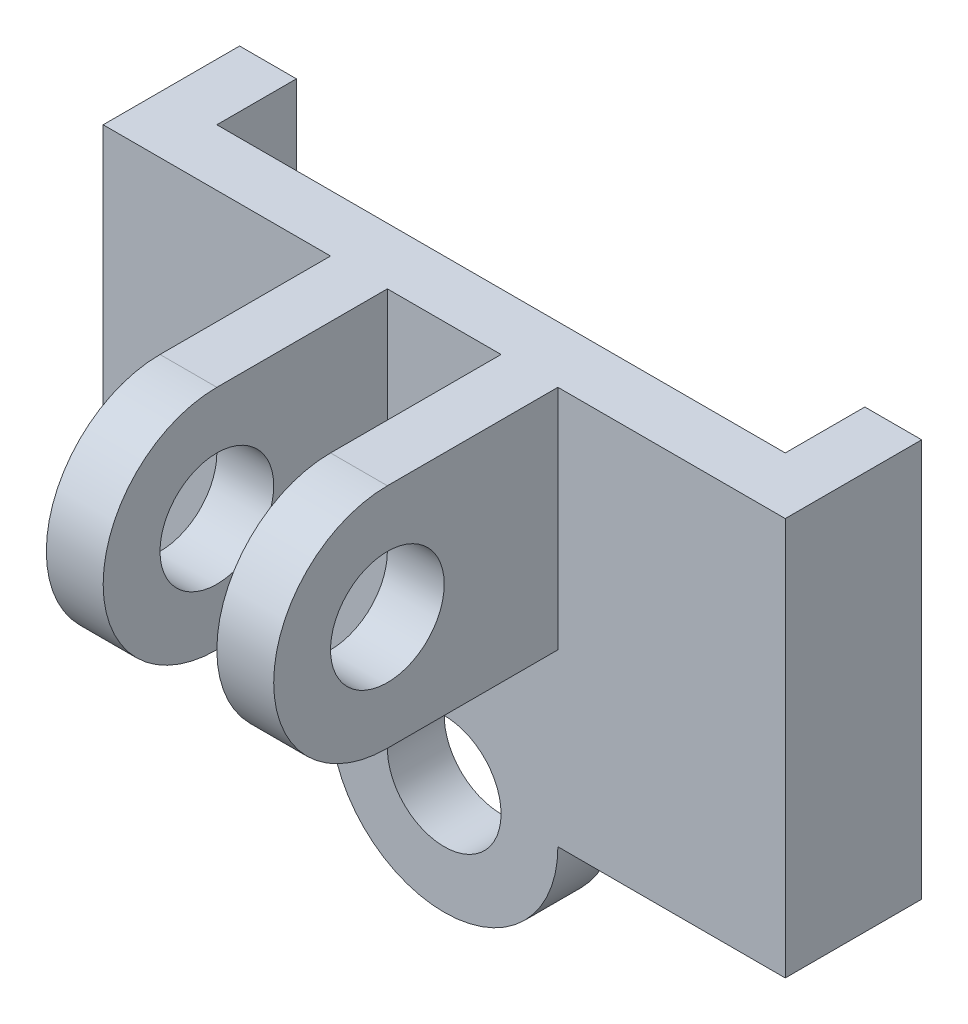
ISO-10303-21;
HEADER;
FILE_DESCRIPTION(('STEP AP214'),'2;1');
FILE_NAME('part.step','',(''),(''),'','','');
FILE_SCHEMA(('AUTOMOTIVE_DESIGN { 1 0 10303 214 1 1 1 1 }'));
ENDSEC;
DATA;
#1=APPLICATION_CONTEXT('core data for automotive mechanical design processes');
#2=APPLICATION_PROTOCOL_DEFINITION('international standard','automotive_design',2000,#1);
#3=PRODUCT_CONTEXT('',#1,'mechanical');
#4=PRODUCT('Part','Part','',(#3));
#5=PRODUCT_RELATED_PRODUCT_CATEGORY('part','',(#4));
#6=PRODUCT_DEFINITION_FORMATION('','',#4);
#7=PRODUCT_DEFINITION_CONTEXT('part definition',#1,'design');
#8=PRODUCT_DEFINITION('design','',#6,#7);
#9=PRODUCT_DEFINITION_SHAPE('','',#8);
#10=(LENGTH_UNIT() NAMED_UNIT(*) SI_UNIT(.MILLI.,.METRE.));
#11=(NAMED_UNIT(*) PLANE_ANGLE_UNIT() SI_UNIT($,.RADIAN.));
#12=(NAMED_UNIT(*) SI_UNIT($,.STERADIAN.) SOLID_ANGLE_UNIT());
#13=UNCERTAINTY_MEASURE_WITH_UNIT(LENGTH_MEASURE(1.E-05),#10,'distance_accuracy_value','');
#14=(GEOMETRIC_REPRESENTATION_CONTEXT(3) GLOBAL_UNCERTAINTY_ASSIGNED_CONTEXT((#13)) GLOBAL_UNIT_ASSIGNED_CONTEXT((#10,
#11,#12)) REPRESENTATION_CONTEXT('',''));
#15=CARTESIAN_POINT('',(0.,0.,0.));
#16=DIRECTION('',(0.,0.,1.));
#17=DIRECTION('',(1.,0.,0.));
#18=AXIS2_PLACEMENT_3D('',#15,#16,#17);
#19=CARTESIAN_POINT('',(30.,0.,12.));
#20=DIRECTION('',(0.,0.,-1.));
#21=DIRECTION('',(-1.,0.,0.));
#22=AXIS2_PLACEMENT_3D('',#19,#20,#21);
#23=PLANE('',#22);
#24=CARTESIAN_POINT('',(30.,0.,12.));
#25=DIRECTION('',(0.,0.,1.));
#26=DIRECTION('',(1.,0.,0.));
#27=AXIS2_PLACEMENT_3D('',#24,#25,#26);
#28=CIRCLE('',#27,5.);
#29=CARTESIAN_POINT('',(35.,0.,12.));
#30=VERTEX_POINT('',#29);
#31=EDGE_CURVE('E305',#30,#30,#28,.T.);
#32=ORIENTED_EDGE('',*,*,#31,.F.);
#33=EDGE_LOOP('',(#32));
#34=FACE_BOUND('',#33,.T.);
#35=DIRECTION('',(0.,-1.,0.));
#36=VECTOR('',#35,1.);
#37=CARTESIAN_POINT('',(35.,35.,12.));
#38=LINE('',#37,#36);
#39=CARTESIAN_POINT('',(35.,35.,12.));
#40=VERTEX_POINT('',#39);
#41=CARTESIAN_POINT('',(35.,15.,12.));
#42=VERTEX_POINT('',#41);
#43=EDGE_CURVE('E204',#40,#42,#38,.T.);
#44=ORIENTED_EDGE('',*,*,#43,.F.);
#45=DIRECTION('',(-1.,0.,0.));
#46=VECTOR('',#45,1.);
#47=CARTESIAN_POINT('',(60.,35.,12.));
#48=LINE('',#47,#46);
#49=CARTESIAN_POINT('',(25.,35.,12.));
#50=VERTEX_POINT('',#49);
#51=EDGE_CURVE('E40',#40,#50,#48,.T.);
#52=ORIENTED_EDGE('',*,*,#51,.T.);
#53=DIRECTION('',(0.,1.,0.));
#54=VECTOR('',#53,1.);
#55=CARTESIAN_POINT('',(25.,35.,12.));
#56=LINE('',#55,#54);
#57=CARTESIAN_POINT('',(25.,15.,12.));
#58=VERTEX_POINT('',#57);
#59=EDGE_CURVE('E184',#58,#50,#56,.T.);
#60=ORIENTED_EDGE('',*,*,#59,.F.);
#61=DIRECTION('',(1.,0.,0.));
#62=VECTOR('',#61,1.);
#63=CARTESIAN_POINT('',(20.,15.,12.));
#64=LINE('',#63,#62);
#65=CARTESIAN_POINT('',(20.,15.,12.));
#66=VERTEX_POINT('',#65);
#67=EDGE_CURVE('E226',#66,#58,#64,.T.);
#68=ORIENTED_EDGE('',*,*,#67,.F.);
#69=DIRECTION('',(0.,-1.,0.));
#70=VECTOR('',#69,1.);
#71=CARTESIAN_POINT('',(20.,35.,12.));
#72=LINE('',#71,#70);
#73=CARTESIAN_POINT('',(20.,35.,12.));
#74=VERTEX_POINT('',#73);
#75=EDGE_CURVE('E170',#74,#66,#72,.T.);
#76=ORIENTED_EDGE('',*,*,#75,.F.);
#77=CARTESIAN_POINT('',(0.,35.,12.));
#78=VERTEX_POINT('',#77);
#79=EDGE_CURVE('E246',#74,#78,#48,.T.);
#80=ORIENTED_EDGE('',*,*,#79,.T.);
#81=DIRECTION('',(0.,-1.,0.));
#82=VECTOR('',#81,1.);
#83=CARTESIAN_POINT('',(0.,35.,12.));
#84=LINE('',#83,#82);
#85=CARTESIAN_POINT('',(0.,0.,12.));
#86=VERTEX_POINT('',#85);
#87=EDGE_CURVE('E322',#78,#86,#84,.T.);
#88=ORIENTED_EDGE('',*,*,#87,.T.);
#89=DIRECTION('',(1.,0.,0.));
#90=VECTOR('',#89,1.);
#91=CARTESIAN_POINT('',(0.,0.,12.));
#92=LINE('',#91,#90);
#93=CARTESIAN_POINT('',(20.,0.,12.));
#94=VERTEX_POINT('',#93);
#95=EDGE_CURVE('E325',#86,#94,#92,.T.);
#96=ORIENTED_EDGE('',*,*,#95,.T.);
#97=CARTESIAN_POINT('',(30.,0.,12.));
#98=DIRECTION('',(0.,0.,1.));
#99=DIRECTION('',(-1.,0.,0.));
#100=AXIS2_PLACEMENT_3D('',#97,#98,#99);
#101=CIRCLE('',#100,10.);
#102=CARTESIAN_POINT('',(40.,0.,12.));
#103=VERTEX_POINT('',#102);
#104=EDGE_CURVE('E327',#94,#103,#101,.T.);
#105=ORIENTED_EDGE('',*,*,#104,.T.);
#106=DIRECTION('',(1.,0.,0.));
#107=VECTOR('',#106,1.);
#108=CARTESIAN_POINT('',(40.,0.,12.));
#109=LINE('',#108,#107);
#110=CARTESIAN_POINT('',(60.,0.,12.));
#111=VERTEX_POINT('',#110);
#112=EDGE_CURVE('E328',#103,#111,#109,.T.);
#113=ORIENTED_EDGE('',*,*,#112,.T.);
#114=DIRECTION('',(0.,1.,0.));
#115=VECTOR('',#114,1.);
#116=CARTESIAN_POINT('',(60.,0.,12.));
#117=LINE('',#116,#115);
#118=CARTESIAN_POINT('',(60.,35.,12.));
#119=VERTEX_POINT('',#118);
#120=EDGE_CURVE('E248',#111,#119,#117,.T.);
#121=ORIENTED_EDGE('',*,*,#120,.T.);
#122=CARTESIAN_POINT('',(40.,35.,12.));
#123=VERTEX_POINT('',#122);
#124=EDGE_CURVE('E249',#119,#123,#48,.T.);
#125=ORIENTED_EDGE('',*,*,#124,.T.);
#126=DIRECTION('',(0.,1.,0.));
#127=VECTOR('',#126,1.);
#128=CARTESIAN_POINT('',(40.,35.,12.));
#129=LINE('',#128,#127);
#130=CARTESIAN_POINT('',(40.,15.,12.));
#131=VERTEX_POINT('',#130);
#132=EDGE_CURVE('E59',#131,#123,#129,.T.);
#133=ORIENTED_EDGE('',*,*,#132,.F.);
#134=DIRECTION('',(1.,0.,0.));
#135=VECTOR('',#134,1.);
#136=CARTESIAN_POINT('',(35.,15.,12.));
#137=LINE('',#136,#135);
#138=EDGE_CURVE('E54',#42,#131,#137,.T.);
#139=ORIENTED_EDGE('',*,*,#138,.F.);
#140=EDGE_LOOP('',(#44,#52,#60,#68,#76,#80,#88,#96,#105,#113,#121,#125,#133,#139));
#141=FACE_BOUND('',#140,.T.);
#142=ADVANCED_FACE('F36',(#34,#141),#23,.F.);
#143=CARTESIAN_POINT('',(30.,0.,0.));
#144=DIRECTION('',(0.,0.,-1.));
#145=DIRECTION('',(-1.,0.,0.));
#146=AXIS2_PLACEMENT_3D('',#143,#144,#145);
#147=PLANE('',#146);
#148=DIRECTION('',(0.,1.,0.));
#149=VECTOR('',#148,1.);
#150=CARTESIAN_POINT('',(55.,-25.,0.));
#151=LINE('',#150,#149);
#152=CARTESIAN_POINT('',(55.,0.,0.));
#153=VERTEX_POINT('',#152);
#154=CARTESIAN_POINT('',(55.,35.,0.));
#155=VERTEX_POINT('',#154);
#156=EDGE_CURVE('E291',#153,#155,#151,.T.);
#157=ORIENTED_EDGE('',*,*,#156,.T.);
#158=DIRECTION('',(-1.,0.,0.));
#159=VECTOR('',#158,1.);
#160=CARTESIAN_POINT('',(60.,35.,0.));
#161=LINE('',#160,#159);
#162=CARTESIAN_POINT('',(60.,35.,0.));
#163=VERTEX_POINT('',#162);
#164=EDGE_CURVE('E319',#163,#155,#161,.T.);
#165=ORIENTED_EDGE('',*,*,#164,.F.);
#166=DIRECTION('',(0.,1.,0.));
#167=VECTOR('',#166,1.);
#168=CARTESIAN_POINT('',(60.,0.,0.));
#169=LINE('',#168,#167);
#170=CARTESIAN_POINT('',(60.,0.,0.));
#171=VERTEX_POINT('',#170);
#172=EDGE_CURVE('E316',#171,#163,#169,.T.);
#173=ORIENTED_EDGE('',*,*,#172,.F.);
#174=DIRECTION('',(1.,0.,0.));
#175=VECTOR('',#174,1.);
#176=CARTESIAN_POINT('',(40.,0.,0.));
#177=LINE('',#176,#175);
#178=EDGE_CURVE('E314',#153,#171,#177,.T.);
#179=ORIENTED_EDGE('',*,*,#178,.F.);
#180=EDGE_LOOP('',(#157,#165,#173,#179));
#181=FACE_BOUND('',#180,.T.);
#182=ADVANCED_FACE('F359',(#181),#147,.T.);
#183=CARTESIAN_POINT('',(0.,35.,12.));
#184=DIRECTION('',(1.,0.,0.));
#185=DIRECTION('',(0.,0.,-1.));
#186=AXIS2_PLACEMENT_3D('',#183,#184,#185);
#187=PLANE('',#186);
#188=DIRECTION('',(0.,-1.,0.));
#189=VECTOR('',#188,1.);
#190=CARTESIAN_POINT('',(0.,35.,0.));
#191=LINE('',#190,#189);
#192=CARTESIAN_POINT('',(0.,35.,0.));
#193=VERTEX_POINT('',#192);
#194=CARTESIAN_POINT('',(0.,0.,0.));
#195=VERTEX_POINT('',#194);
#196=EDGE_CURVE('E308',#193,#195,#191,.T.);
#197=ORIENTED_EDGE('',*,*,#196,.T.);
#198=DIRECTION('',(0.,0.,-1.));
#199=VECTOR('',#198,1.);
#200=CARTESIAN_POINT('',(0.,0.,12.));
#201=LINE('',#200,#199);
#202=EDGE_CURVE('E13',#86,#195,#201,.T.);
#203=ORIENTED_EDGE('',*,*,#202,.F.);
#204=ORIENTED_EDGE('',*,*,#87,.F.);
#205=DIRECTION('',(0.,0.,-1.));
#206=VECTOR('',#205,1.);
#207=CARTESIAN_POINT('',(0.,35.,12.));
#208=LINE('',#207,#206);
#209=EDGE_CURVE('E255',#78,#193,#208,.T.);
#210=ORIENTED_EDGE('',*,*,#209,.T.);
#211=EDGE_LOOP('',(#197,#203,#204,#210));
#212=FACE_BOUND('',#211,.T.);
#213=ADVANCED_FACE('F38',(#212),#187,.F.);
#214=CARTESIAN_POINT('',(0.,0.,12.));
#215=DIRECTION('',(0.,1.,0.));
#216=DIRECTION('',(0.,0.,1.));
#217=AXIS2_PLACEMENT_3D('',#214,#215,#216);
#218=PLANE('',#217);
#219=DIRECTION('',(0.,0.,1.));
#220=VECTOR('',#219,1.);
#221=CARTESIAN_POINT('',(5.,0.,12.));
#222=LINE('',#221,#220);
#223=CARTESIAN_POINT('',(5.,0.,0.));
#224=VERTEX_POINT('',#223);
#225=CARTESIAN_POINT('',(5.,0.,7.));
#226=VERTEX_POINT('',#225);
#227=EDGE_CURVE('E299',#224,#226,#222,.T.);
#228=ORIENTED_EDGE('',*,*,#227,.T.);
#229=DIRECTION('',(1.,0.,0.));
#230=VECTOR('',#229,1.);
#231=CARTESIAN_POINT('',(0.,0.,7.));
#232=LINE('',#231,#230);
#233=CARTESIAN_POINT('',(20.,0.,7.));
#234=VERTEX_POINT('',#233);
#235=EDGE_CURVE('E296',#226,#234,#232,.T.);
#236=ORIENTED_EDGE('',*,*,#235,.T.);
#237=DIRECTION('',(0.,0.,-1.));
#238=VECTOR('',#237,1.);
#239=CARTESIAN_POINT('',(20.,0.,12.));
#240=LINE('',#239,#238);
#241=EDGE_CURVE('E46',#94,#234,#240,.T.);
#242=ORIENTED_EDGE('',*,*,#241,.F.);
#243=ORIENTED_EDGE('',*,*,#95,.F.);
#244=ORIENTED_EDGE('',*,*,#202,.T.);
#245=DIRECTION('',(1.,0.,0.));
#246=VECTOR('',#245,1.);
#247=CARTESIAN_POINT('',(0.,0.,0.));
#248=LINE('',#247,#246);
#249=EDGE_CURVE('E311',#195,#224,#248,.T.);
#250=ORIENTED_EDGE('',*,*,#249,.T.);
#251=EDGE_LOOP('',(#228,#236,#242,#243,#244,#250));
#252=FACE_BOUND('',#251,.T.);
#253=ADVANCED_FACE('F350',(#252),#218,.F.);
#254=CARTESIAN_POINT('',(30.,0.,12.));
#255=DIRECTION('',(0.,0.,-1.));
#256=DIRECTION('',(-1.,0.,0.));
#257=AXIS2_PLACEMENT_3D('',#254,#255,#256);
#258=CYLINDRICAL_SURFACE('',#257,10.);
#259=ORIENTED_EDGE('',*,*,#241,.T.);
#260=CARTESIAN_POINT('',(30.,0.,7.));
#261=DIRECTION('',(0.,0.,1.));
#262=DIRECTION('',(1.,0.,0.));
#263=AXIS2_PLACEMENT_3D('',#260,#261,#262);
#264=CIRCLE('',#263,10.);
#265=CARTESIAN_POINT('',(40.,0.,7.));
#266=VERTEX_POINT('',#265);
#267=EDGE_CURVE('E277',#234,#266,#264,.T.);
#268=ORIENTED_EDGE('',*,*,#267,.T.);
#269=DIRECTION('',(0.,0.,-1.));
#270=VECTOR('',#269,1.);
#271=CARTESIAN_POINT('',(40.,0.,12.));
#272=LINE('',#271,#270);
#273=EDGE_CURVE('E266',#103,#266,#272,.T.);
#274=ORIENTED_EDGE('',*,*,#273,.F.);
#275=ORIENTED_EDGE('',*,*,#104,.F.);
#276=EDGE_LOOP('',(#259,#268,#274,#275));
#277=FACE_BOUND('',#276,.T.);
#278=ADVANCED_FACE('F354',(#277),#258,.T.);
#279=CARTESIAN_POINT('',(40.,0.,12.));
#280=DIRECTION('',(0.,1.,0.));
#281=DIRECTION('',(0.,0.,1.));
#282=AXIS2_PLACEMENT_3D('',#279,#280,#281);
#283=PLANE('',#282);
#284=DIRECTION('',(1.,0.,0.));
#285=VECTOR('',#284,1.);
#286=CARTESIAN_POINT('',(40.,0.,7.));
#287=LINE('',#286,#285);
#288=CARTESIAN_POINT('',(55.,0.,7.));
#289=VERTEX_POINT('',#288);
#290=EDGE_CURVE('E272',#266,#289,#287,.T.);
#291=ORIENTED_EDGE('',*,*,#290,.T.);
#292=DIRECTION('',(0.,0.,-1.));
#293=VECTOR('',#292,1.);
#294=CARTESIAN_POINT('',(55.,0.,12.));
#295=LINE('',#294,#293);
#296=EDGE_CURVE('E302',#289,#153,#295,.T.);
#297=ORIENTED_EDGE('',*,*,#296,.T.);
#298=ORIENTED_EDGE('',*,*,#178,.T.);
#299=DIRECTION('',(0.,0.,-1.));
#300=VECTOR('',#299,1.);
#301=CARTESIAN_POINT('',(60.,0.,12.));
#302=LINE('',#301,#300);
#303=EDGE_CURVE('E263',#111,#171,#302,.T.);
#304=ORIENTED_EDGE('',*,*,#303,.F.);
#305=ORIENTED_EDGE('',*,*,#112,.F.);
#306=ORIENTED_EDGE('',*,*,#273,.T.);
#307=EDGE_LOOP('',(#291,#297,#298,#304,#305,#306));
#308=FACE_BOUND('',#307,.T.);
#309=ADVANCED_FACE('F356',(#308),#283,.F.);
#310=CARTESIAN_POINT('',(60.,0.,12.));
#311=DIRECTION('',(-1.,0.,0.));
#312=DIRECTION('',(0.,0.,1.));
#313=AXIS2_PLACEMENT_3D('',#310,#311,#312);
#314=PLANE('',#313);
#315=ORIENTED_EDGE('',*,*,#172,.T.);
#316=DIRECTION('',(0.,0.,-1.));
#317=VECTOR('',#316,1.);
#318=CARTESIAN_POINT('',(60.,35.,12.));
#319=LINE('',#318,#317);
#320=EDGE_CURVE('E260',#119,#163,#319,.T.);
#321=ORIENTED_EDGE('',*,*,#320,.F.);
#322=ORIENTED_EDGE('',*,*,#120,.F.);
#323=ORIENTED_EDGE('',*,*,#303,.T.);
#324=EDGE_LOOP('',(#315,#321,#322,#323));
#325=FACE_BOUND('',#324,.T.);
#326=ADVANCED_FACE('F335',(#325),#314,.F.);
#327=CARTESIAN_POINT('',(60.,35.,12.));
#328=DIRECTION('',(0.,-1.,0.));
#329=DIRECTION('',(1.,0.,0.));
#330=AXIS2_PLACEMENT_3D('',#327,#328,#329);
#331=PLANE('',#330);
#332=ORIENTED_EDGE('',*,*,#164,.T.);
#333=DIRECTION('',(0.,0.,-1.));
#334=VECTOR('',#333,1.);
#335=CARTESIAN_POINT('',(55.,35.,0.));
#336=LINE('',#335,#334);
#337=CARTESIAN_POINT('',(55.,35.,7.));
#338=VERTEX_POINT('',#337);
#339=EDGE_CURVE('E173',#338,#155,#336,.T.);
#340=ORIENTED_EDGE('',*,*,#339,.F.);
#341=DIRECTION('',(1.,0.,0.));
#342=VECTOR('',#341,1.);
#343=CARTESIAN_POINT('',(55.,35.,7.));
#344=LINE('',#343,#342);
#345=CARTESIAN_POINT('',(5.00000000000001,35.,7.));
#346=VERTEX_POINT('',#345);
#347=EDGE_CURVE('E287',#346,#338,#344,.T.);
#348=ORIENTED_EDGE('',*,*,#347,.F.);
#349=DIRECTION('',(0.,0.,1.));
#350=VECTOR('',#349,1.);
#351=CARTESIAN_POINT('',(5.00000000000001,35.,0.));
#352=LINE('',#351,#350);
#353=CARTESIAN_POINT('',(5.00000000000001,35.,0.));
#354=VERTEX_POINT('',#353);
#355=EDGE_CURVE('E363',#354,#346,#352,.T.);
#356=ORIENTED_EDGE('',*,*,#355,.F.);
#357=EDGE_CURVE('E318',#354,#193,#161,.T.);
#358=ORIENTED_EDGE('',*,*,#357,.T.);
#359=ORIENTED_EDGE('',*,*,#209,.F.);
#360=ORIENTED_EDGE('',*,*,#79,.F.);
#361=DIRECTION('',(0.,0.,-1.));
#362=VECTOR('',#361,1.);
#363=CARTESIAN_POINT('',(20.,35.,27.));
#364=LINE('',#363,#362);
#365=CARTESIAN_POINT('',(20.,35.,27.));
#366=VERTEX_POINT('',#365);
#367=EDGE_CURVE('E238',#366,#74,#364,.T.);
#368=ORIENTED_EDGE('',*,*,#367,.F.);
#369=DIRECTION('',(-1.,0.,0.));
#370=VECTOR('',#369,1.);
#371=CARTESIAN_POINT('',(20.,35.,27.));
#372=LINE('',#371,#370);
#373=CARTESIAN_POINT('',(25.,35.,27.));
#374=VERTEX_POINT('',#373);
#375=EDGE_CURVE('E183',#374,#366,#372,.T.);
#376=ORIENTED_EDGE('',*,*,#375,.F.);
#377=DIRECTION('',(0.,0.,-1.));
#378=VECTOR('',#377,1.);
#379=CARTESIAN_POINT('',(25.,35.,27.));
#380=LINE('',#379,#378);
#381=EDGE_CURVE('E236',#374,#50,#380,.T.);
#382=ORIENTED_EDGE('',*,*,#381,.T.);
#383=ORIENTED_EDGE('',*,*,#51,.F.);
#384=DIRECTION('',(0.,0.,-1.));
#385=VECTOR('',#384,1.);
#386=CARTESIAN_POINT('',(35.,35.,27.));
#387=LINE('',#386,#385);
#388=CARTESIAN_POINT('',(35.,35.,27.));
#389=VERTEX_POINT('',#388);
#390=EDGE_CURVE('E215',#389,#40,#387,.T.);
#391=ORIENTED_EDGE('',*,*,#390,.F.);
#392=DIRECTION('',(-1.,0.,0.));
#393=VECTOR('',#392,1.);
#394=CARTESIAN_POINT('',(35.,35.,27.));
#395=LINE('',#394,#393);
#396=CARTESIAN_POINT('',(40.,35.,27.));
#397=VERTEX_POINT('',#396);
#398=EDGE_CURVE('E212',#397,#389,#395,.T.);
#399=ORIENTED_EDGE('',*,*,#398,.F.);
#400=DIRECTION('',(0.,0.,-1.));
#401=VECTOR('',#400,1.);
#402=CARTESIAN_POINT('',(40.,35.,27.));
#403=LINE('',#402,#401);
#404=EDGE_CURVE('E218',#397,#123,#403,.T.);
#405=ORIENTED_EDGE('',*,*,#404,.T.);
#406=ORIENTED_EDGE('',*,*,#124,.F.);
#407=ORIENTED_EDGE('',*,*,#320,.T.);
#408=EDGE_LOOP('',(#332,#340,#348,#356,#358,#359,#360,#368,#376,#382,#383,#391,#399,#405,#406,#407));
#409=FACE_BOUND('',#408,.T.);
#410=ADVANCED_FACE('F338',(#409),#331,.F.);
#411=DIRECTION('',(0.,1.,0.));
#412=VECTOR('',#411,1.);
#413=CARTESIAN_POINT('',(4.99999999999999,-25.,0.));
#414=LINE('',#413,#412);
#415=EDGE_CURVE('E284',#224,#354,#414,.T.);
#416=ORIENTED_EDGE('',*,*,#415,.F.);
#417=ORIENTED_EDGE('',*,*,#249,.F.);
#418=ORIENTED_EDGE('',*,*,#196,.F.);
#419=ORIENTED_EDGE('',*,*,#357,.F.);
#420=EDGE_LOOP('',(#416,#417,#418,#419));
#421=FACE_BOUND('',#420,.T.);
#422=ADVANCED_FACE('F374',(#421),#147,.T.);
#423=CARTESIAN_POINT('',(30.,0.,0.));
#424=DIRECTION('',(0.,0.,1.));
#425=DIRECTION('',(1.,0.,0.));
#426=AXIS2_PLACEMENT_3D('',#423,#424,#425);
#427=CYLINDRICAL_SURFACE('',#426,5.);
#428=CARTESIAN_POINT('',(30.,0.,7.));
#429=DIRECTION('',(0.,0.,1.));
#430=DIRECTION('',(1.,0.,0.));
#431=AXIS2_PLACEMENT_3D('',#428,#429,#430);
#432=CIRCLE('',#431,5.);
#433=CARTESIAN_POINT('',(35.,0.,7.));
#434=VERTEX_POINT('',#433);
#435=EDGE_CURVE('E270',#434,#434,#432,.F.);
#436=ORIENTED_EDGE('',*,*,#435,.T.);
#437=EDGE_LOOP('',(#436));
#438=FACE_BOUND('',#437,.T.);
#439=ORIENTED_EDGE('',*,*,#31,.T.);
#440=EDGE_LOOP('',(#439));
#441=FACE_BOUND('',#440,.T.);
#442=ADVANCED_FACE('F376',(#438,#441),#427,.F.);
#443=CARTESIAN_POINT('',(55.,-25.,0.));
#444=DIRECTION('',(1.,0.,0.));
#445=DIRECTION('',(0.,1.,0.));
#446=AXIS2_PLACEMENT_3D('',#443,#444,#445);
#447=PLANE('',#446);
#448=DIRECTION('',(0.,1.,0.));
#449=VECTOR('',#448,1.);
#450=CARTESIAN_POINT('',(55.,-25.,7.));
#451=LINE('',#450,#449);
#452=EDGE_CURVE('E273',#289,#338,#451,.T.);
#453=ORIENTED_EDGE('',*,*,#452,.T.);
#454=ORIENTED_EDGE('',*,*,#339,.T.);
#455=ORIENTED_EDGE('',*,*,#156,.F.);
#456=ORIENTED_EDGE('',*,*,#296,.F.);
#457=EDGE_LOOP('',(#453,#454,#455,#456));
#458=FACE_BOUND('',#457,.T.);
#459=ADVANCED_FACE('F382',(#458),#447,.F.);
#460=CARTESIAN_POINT('',(4.99999999999999,-25.,0.));
#461=DIRECTION('',(-1.,0.,0.));
#462=DIRECTION('',(0.,-1.,0.));
#463=AXIS2_PLACEMENT_3D('',#460,#461,#462);
#464=PLANE('',#463);
#465=ORIENTED_EDGE('',*,*,#415,.T.);
#466=ORIENTED_EDGE('',*,*,#355,.T.);
#467=DIRECTION('',(0.,1.,0.));
#468=VECTOR('',#467,1.);
#469=CARTESIAN_POINT('',(4.99999999999999,-25.,7.));
#470=LINE('',#469,#468);
#471=EDGE_CURVE('E279',#226,#346,#470,.T.);
#472=ORIENTED_EDGE('',*,*,#471,.F.);
#473=ORIENTED_EDGE('',*,*,#227,.F.);
#474=EDGE_LOOP('',(#465,#466,#472,#473));
#475=FACE_BOUND('',#474,.T.);
#476=ADVANCED_FACE('F370',(#475),#464,.F.);
#477=CARTESIAN_POINT('',(55.,-25.,7.));
#478=DIRECTION('',(0.,0.,1.));
#479=DIRECTION('',(1.,0.,0.));
#480=AXIS2_PLACEMENT_3D('',#477,#478,#479);
#481=PLANE('',#480);
#482=ORIENTED_EDGE('',*,*,#435,.F.);
#483=EDGE_LOOP('',(#482));
#484=FACE_BOUND('',#483,.T.);
#485=ORIENTED_EDGE('',*,*,#471,.T.);
#486=ORIENTED_EDGE('',*,*,#347,.T.);
#487=ORIENTED_EDGE('',*,*,#452,.F.);
#488=ORIENTED_EDGE('',*,*,#290,.F.);
#489=ORIENTED_EDGE('',*,*,#267,.F.);
#490=ORIENTED_EDGE('',*,*,#235,.F.);
#491=EDGE_LOOP('',(#485,#486,#487,#488,#489,#490));
#492=FACE_BOUND('',#491,.T.);
#493=ADVANCED_FACE('F369',(#484,#492),#481,.F.);
#494=CARTESIAN_POINT('',(20.,35.,27.));
#495=DIRECTION('',(1.,0.,0.));
#496=DIRECTION('',(0.,0.,-1.));
#497=AXIS2_PLACEMENT_3D('',#494,#495,#496);
#498=PLANE('',#497);
#499=CARTESIAN_POINT('',(20.,25.,27.));
#500=DIRECTION('',(1.,0.,0.));
#501=DIRECTION('',(0.,0.,-1.));
#502=AXIS2_PLACEMENT_3D('',#499,#500,#501);
#503=CIRCLE('',#502,5.);
#504=CARTESIAN_POINT('',(20.,25.,22.));
#505=VERTEX_POINT('',#504);
#506=EDGE_CURVE('E190',#505,#505,#503,.T.);
#507=ORIENTED_EDGE('',*,*,#506,.T.);
#508=EDGE_LOOP('',(#507));
#509=FACE_BOUND('',#508,.T.);
#510=ORIENTED_EDGE('',*,*,#75,.T.);
#511=DIRECTION('',(0.,0.,-1.));
#512=VECTOR('',#511,1.);
#513=CARTESIAN_POINT('',(20.,15.,27.));
#514=LINE('',#513,#512);
#515=CARTESIAN_POINT('',(20.,15.,27.));
#516=VERTEX_POINT('',#515);
#517=EDGE_CURVE('E164',#516,#66,#514,.T.);
#518=ORIENTED_EDGE('',*,*,#517,.F.);
#519=CARTESIAN_POINT('',(20.,25.,27.));
#520=DIRECTION('',(-1.,0.,0.));
#521=DIRECTION('',(0.,0.,-1.));
#522=AXIS2_PLACEMENT_3D('',#519,#520,#521);
#523=CIRCLE('',#522,10.);
#524=EDGE_CURVE('E169',#516,#366,#523,.T.);
#525=ORIENTED_EDGE('',*,*,#524,.T.);
#526=ORIENTED_EDGE('',*,*,#367,.T.);
#527=EDGE_LOOP('',(#510,#518,#525,#526));
#528=FACE_BOUND('',#527,.T.);
#529=ADVANCED_FACE('F166',(#509,#528),#498,.F.);
#530=CARTESIAN_POINT('',(20.,15.,27.));
#531=DIRECTION('',(0.,1.,0.));
#532=DIRECTION('',(0.,0.,1.));
#533=AXIS2_PLACEMENT_3D('',#530,#531,#532);
#534=PLANE('',#533);
#535=ORIENTED_EDGE('',*,*,#67,.T.);
#536=DIRECTION('',(0.,0.,-1.));
#537=VECTOR('',#536,1.);
#538=CARTESIAN_POINT('',(25.,15.,27.));
#539=LINE('',#538,#537);
#540=CARTESIAN_POINT('',(25.,15.,27.));
#541=VERTEX_POINT('',#540);
#542=EDGE_CURVE('E174',#541,#58,#539,.T.);
#543=ORIENTED_EDGE('',*,*,#542,.F.);
#544=DIRECTION('',(1.,0.,0.));
#545=VECTOR('',#544,1.);
#546=CARTESIAN_POINT('',(20.,15.,27.));
#547=LINE('',#546,#545);
#548=EDGE_CURVE('E177',#516,#541,#547,.T.);
#549=ORIENTED_EDGE('',*,*,#548,.F.);
#550=ORIENTED_EDGE('',*,*,#517,.T.);
#551=EDGE_LOOP('',(#535,#543,#549,#550));
#552=FACE_BOUND('',#551,.T.);
#553=ADVANCED_FACE('F178',(#552),#534,.F.);
#554=CARTESIAN_POINT('',(25.,35.,27.));
#555=DIRECTION('',(-1.,0.,0.));
#556=DIRECTION('',(0.,0.,1.));
#557=AXIS2_PLACEMENT_3D('',#554,#555,#556);
#558=PLANE('',#557);
#559=CARTESIAN_POINT('',(25.,25.,27.));
#560=DIRECTION('',(-1.,0.,0.));
#561=DIRECTION('',(0.,0.,1.));
#562=AXIS2_PLACEMENT_3D('',#559,#560,#561);
#563=CIRCLE('',#562,5.);
#564=CARTESIAN_POINT('',(25.,25.,32.));
#565=VERTEX_POINT('',#564);
#566=EDGE_CURVE('E195',#565,#565,#563,.T.);
#567=ORIENTED_EDGE('',*,*,#566,.T.);
#568=EDGE_LOOP('',(#567));
#569=FACE_BOUND('',#568,.T.);
#570=ORIENTED_EDGE('',*,*,#59,.T.);
#571=ORIENTED_EDGE('',*,*,#381,.F.);
#572=CARTESIAN_POINT('',(25.,25.,27.));
#573=DIRECTION('',(-1.,0.,0.));
#574=DIRECTION('',(0.,0.,-1.));
#575=AXIS2_PLACEMENT_3D('',#572,#573,#574);
#576=CIRCLE('',#575,10.);
#577=EDGE_CURVE('E189',#541,#374,#576,.T.);
#578=ORIENTED_EDGE('',*,*,#577,.F.);
#579=ORIENTED_EDGE('',*,*,#542,.T.);
#580=EDGE_LOOP('',(#570,#571,#578,#579));
#581=FACE_BOUND('',#580,.T.);
#582=ADVANCED_FACE('F341',(#569,#581),#558,.F.);
#583=CARTESIAN_POINT('',(35.,35.,27.));
#584=DIRECTION('',(1.,0.,0.));
#585=DIRECTION('',(0.,0.,-1.));
#586=AXIS2_PLACEMENT_3D('',#583,#584,#585);
#587=PLANE('',#586);
#588=CARTESIAN_POINT('',(35.,25.,27.));
#589=DIRECTION('',(1.,0.,0.));
#590=DIRECTION('',(0.,0.,-1.));
#591=AXIS2_PLACEMENT_3D('',#588,#589,#590);
#592=CIRCLE('',#591,5.);
#593=CARTESIAN_POINT('',(35.,25.,22.));
#594=VERTEX_POINT('',#593);
#595=EDGE_CURVE('E531',#594,#594,#592,.T.);
#596=ORIENTED_EDGE('',*,*,#595,.T.);
#597=EDGE_LOOP('',(#596));
#598=FACE_BOUND('',#597,.T.);
#599=ORIENTED_EDGE('',*,*,#43,.T.);
#600=DIRECTION('',(0.,0.,-1.));
#601=VECTOR('',#600,1.);
#602=CARTESIAN_POINT('',(35.,15.,27.));
#603=LINE('',#602,#601);
#604=CARTESIAN_POINT('',(35.,15.,27.));
#605=VERTEX_POINT('',#604);
#606=EDGE_CURVE('E224',#605,#42,#603,.T.);
#607=ORIENTED_EDGE('',*,*,#606,.F.);
#608=CARTESIAN_POINT('',(35.,25.,27.));
#609=DIRECTION('',(1.,0.,0.));
#610=DIRECTION('',(0.,0.,-1.));
#611=AXIS2_PLACEMENT_3D('',#608,#609,#610);
#612=CIRCLE('',#611,10.);
#613=EDGE_CURVE('E201',#389,#605,#612,.T.);
#614=ORIENTED_EDGE('',*,*,#613,.F.);
#615=ORIENTED_EDGE('',*,*,#390,.T.);
#616=EDGE_LOOP('',(#599,#607,#614,#615));
#617=FACE_BOUND('',#616,.T.);
#618=ADVANCED_FACE('F467',(#598,#617),#587,.F.);
#619=CARTESIAN_POINT('',(35.,15.,27.));
#620=DIRECTION('',(0.,1.,0.));
#621=DIRECTION('',(0.,0.,1.));
#622=AXIS2_PLACEMENT_3D('',#619,#620,#621);
#623=PLANE('',#622);
#624=ORIENTED_EDGE('',*,*,#138,.T.);
#625=DIRECTION('',(0.,0.,-1.));
#626=VECTOR('',#625,1.);
#627=CARTESIAN_POINT('',(40.,15.,27.));
#628=LINE('',#627,#626);
#629=CARTESIAN_POINT('',(40.,15.,27.));
#630=VERTEX_POINT('',#629);
#631=EDGE_CURVE('E221',#630,#131,#628,.T.);
#632=ORIENTED_EDGE('',*,*,#631,.F.);
#633=DIRECTION('',(1.,0.,0.));
#634=VECTOR('',#633,1.);
#635=CARTESIAN_POINT('',(35.,15.,27.));
#636=LINE('',#635,#634);
#637=EDGE_CURVE('E209',#605,#630,#636,.T.);
#638=ORIENTED_EDGE('',*,*,#637,.F.);
#639=ORIENTED_EDGE('',*,*,#606,.T.);
#640=EDGE_LOOP('',(#624,#632,#638,#639));
#641=FACE_BOUND('',#640,.T.);
#642=ADVANCED_FACE('F478',(#641),#623,.F.);
#643=CARTESIAN_POINT('',(40.,35.,27.));
#644=DIRECTION('',(-1.,0.,0.));
#645=DIRECTION('',(0.,0.,1.));
#646=AXIS2_PLACEMENT_3D('',#643,#644,#645);
#647=PLANE('',#646);
#648=CARTESIAN_POINT('',(40.,25.,27.));
#649=DIRECTION('',(1.,0.,0.));
#650=DIRECTION('',(0.,0.,-1.));
#651=AXIS2_PLACEMENT_3D('',#648,#649,#650);
#652=CIRCLE('',#651,5.);
#653=CARTESIAN_POINT('',(40.,25.,22.));
#654=VERTEX_POINT('',#653);
#655=EDGE_CURVE('E533',#654,#654,#652,.T.);
#656=ORIENTED_EDGE('',*,*,#655,.F.);
#657=EDGE_LOOP('',(#656));
#658=FACE_BOUND('',#657,.T.);
#659=ORIENTED_EDGE('',*,*,#132,.T.);
#660=ORIENTED_EDGE('',*,*,#404,.F.);
#661=CARTESIAN_POINT('',(40.,25.,27.));
#662=DIRECTION('',(1.,0.,0.));
#663=DIRECTION('',(0.,0.,-1.));
#664=AXIS2_PLACEMENT_3D('',#661,#662,#663);
#665=CIRCLE('',#664,10.);
#666=EDGE_CURVE('E192',#397,#630,#665,.T.);
#667=ORIENTED_EDGE('',*,*,#666,.T.);
#668=ORIENTED_EDGE('',*,*,#631,.T.);
#669=EDGE_LOOP('',(#659,#660,#667,#668));
#670=FACE_BOUND('',#669,.T.);
#671=ADVANCED_FACE('F488',(#658,#670),#647,.F.);
#672=CARTESIAN_POINT('',(35.,25.,27.));
#673=DIRECTION('',(1.,0.,0.));
#674=DIRECTION('',(0.,0.,-1.));
#675=AXIS2_PLACEMENT_3D('',#672,#673,#674);
#676=CYLINDRICAL_SURFACE('',#675,10.);
#677=ORIENTED_EDGE('',*,*,#666,.F.);
#678=ORIENTED_EDGE('',*,*,#398,.T.);
#679=ORIENTED_EDGE('',*,*,#613,.T.);
#680=ORIENTED_EDGE('',*,*,#637,.T.);
#681=EDGE_LOOP('',(#677,#678,#679,#680));
#682=FACE_BOUND('',#681,.T.);
#683=ADVANCED_FACE('F495',(#682),#676,.T.);
#684=CARTESIAN_POINT('',(25.,25.,27.));
#685=DIRECTION('',(-1.,0.,0.));
#686=DIRECTION('',(0.,0.,1.));
#687=AXIS2_PLACEMENT_3D('',#684,#685,#686);
#688=CYLINDRICAL_SURFACE('',#687,10.);
#689=ORIENTED_EDGE('',*,*,#524,.F.);
#690=ORIENTED_EDGE('',*,*,#548,.T.);
#691=ORIENTED_EDGE('',*,*,#577,.T.);
#692=ORIENTED_EDGE('',*,*,#375,.T.);
#693=EDGE_LOOP('',(#689,#690,#691,#692));
#694=FACE_BOUND('',#693,.T.);
#695=ADVANCED_FACE('F187',(#694),#688,.T.);
#696=CARTESIAN_POINT('',(0.,25.,27.));
#697=DIRECTION('',(1.,0.,0.));
#698=DIRECTION('',(0.,0.,-1.));
#699=AXIS2_PLACEMENT_3D('',#696,#697,#698);
#700=CYLINDRICAL_SURFACE('',#699,5.);
#701=ORIENTED_EDGE('',*,*,#655,.T.);
#702=EDGE_LOOP('',(#701));
#703=FACE_BOUND('',#702,.T.);
#704=ORIENTED_EDGE('',*,*,#595,.F.);
#705=EDGE_LOOP('',(#704));
#706=FACE_BOUND('',#705,.T.);
#707=ADVANCED_FACE('F510',(#703,#706),#700,.F.);
#708=ORIENTED_EDGE('',*,*,#566,.F.);
#709=EDGE_LOOP('',(#708));
#710=FACE_BOUND('',#709,.T.);
#711=ORIENTED_EDGE('',*,*,#506,.F.);
#712=EDGE_LOOP('',(#711));
#713=FACE_BOUND('',#712,.T.);
#714=ADVANCED_FACE('F517',(#710,#713),#700,.F.);
#715=CLOSED_SHELL('',(#142,#182,#213,#253,#278,#309,#326,#410,#422,#442,#459,#476,#493,#529,
#553,#582,#618,#642,#671,#683,#695,#707,#714));
#716=MANIFOLD_SOLID_BREP('B2',#715);
#717=ADVANCED_BREP_SHAPE_REPRESENTATION('',(#18,#716),#14);
#718=SHAPE_DEFINITION_REPRESENTATION(#9,#717);
ENDSEC;
END-ISO-10303-21;
